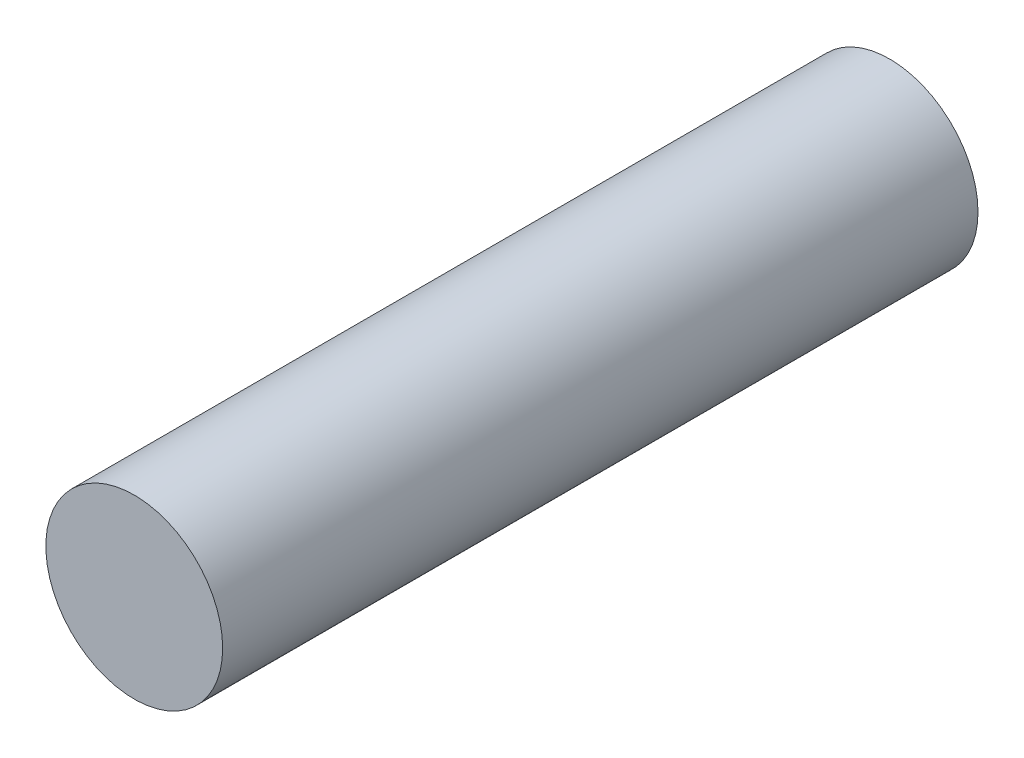
ISO-10303-21;
HEADER;
FILE_DESCRIPTION(('STEP AP214'),'2;1');
FILE_NAME('part.step','',(''),(''),'','','');
FILE_SCHEMA(('AUTOMOTIVE_DESIGN { 1 0 10303 214 1 1 1 1 }'));
ENDSEC;
DATA;
#1=APPLICATION_CONTEXT('core data for automotive mechanical design processes');
#2=APPLICATION_PROTOCOL_DEFINITION('international standard','automotive_design',2000,#1);
#3=PRODUCT_CONTEXT('',#1,'mechanical');
#4=PRODUCT('Part','Part','',(#3));
#5=PRODUCT_RELATED_PRODUCT_CATEGORY('part','',(#4));
#6=PRODUCT_DEFINITION_FORMATION('','',#4);
#7=PRODUCT_DEFINITION_CONTEXT('part definition',#1,'design');
#8=PRODUCT_DEFINITION('design','',#6,#7);
#9=PRODUCT_DEFINITION_SHAPE('','',#8);
#10=(LENGTH_UNIT() NAMED_UNIT(*) SI_UNIT(.MILLI.,.METRE.));
#11=(NAMED_UNIT(*) PLANE_ANGLE_UNIT() SI_UNIT($,.RADIAN.));
#12=(NAMED_UNIT(*) SI_UNIT($,.STERADIAN.) SOLID_ANGLE_UNIT());
#13=UNCERTAINTY_MEASURE_WITH_UNIT(LENGTH_MEASURE(1.E-05),#10,'distance_accuracy_value','');
#14=(GEOMETRIC_REPRESENTATION_CONTEXT(3) GLOBAL_UNCERTAINTY_ASSIGNED_CONTEXT((#13)) GLOBAL_UNIT_ASSIGNED_CONTEXT((#10,
#11,#12)) REPRESENTATION_CONTEXT('',''));
#15=CARTESIAN_POINT('',(0.,0.,0.));
#16=DIRECTION('',(0.,0.,1.));
#17=DIRECTION('',(1.,0.,0.));
#18=AXIS2_PLACEMENT_3D('',#15,#16,#17);
#19=CARTESIAN_POINT('',(0.,0.,44.));
#20=DIRECTION('',(0.,0.,-1.));
#21=DIRECTION('',(-1.,0.,0.));
#22=AXIS2_PLACEMENT_3D('',#19,#20,#21);
#23=CYLINDRICAL_SURFACE('',#22,5.15);
#24=CARTESIAN_POINT('',(0.,0.,44.));
#25=DIRECTION('',(0.,0.,1.));
#26=DIRECTION('',(1.,0.,0.));
#27=AXIS2_PLACEMENT_3D('',#24,#25,#26);
#28=CIRCLE('',#27,5.15);
#29=CARTESIAN_POINT('',(5.15,0.,44.));
#30=VERTEX_POINT('',#29);
#31=EDGE_CURVE('E10',#30,#30,#28,.T.);
#32=ORIENTED_EDGE('',*,*,#31,.F.);
#33=EDGE_LOOP('',(#32));
#34=FACE_BOUND('',#33,.T.);
#35=CARTESIAN_POINT('',(0.,0.,0.));
#36=DIRECTION('',(0.,0.,1.));
#37=DIRECTION('',(1.,0.,0.));
#38=AXIS2_PLACEMENT_3D('',#35,#36,#37);
#39=CIRCLE('',#38,5.15);
#40=CARTESIAN_POINT('',(5.15,0.,0.));
#41=VERTEX_POINT('',#40);
#42=EDGE_CURVE('E32',#41,#41,#39,.T.);
#43=ORIENTED_EDGE('',*,*,#42,.T.);
#44=EDGE_LOOP('',(#43));
#45=FACE_BOUND('',#44,.T.);
#46=ADVANCED_FACE('F29',(#34,#45),#23,.T.);
#47=CARTESIAN_POINT('',(0.,0.,44.));
#48=DIRECTION('',(0.,0.,1.));
#49=DIRECTION('',(1.,0.,0.));
#50=AXIS2_PLACEMENT_3D('',#47,#48,#49);
#51=PLANE('',#50);
#52=ORIENTED_EDGE('',*,*,#31,.T.);
#53=EDGE_LOOP('',(#52));
#54=FACE_BOUND('',#53,.T.);
#55=ADVANCED_FACE('F44',(#54),#51,.T.);
#56=CARTESIAN_POINT('',(0.,0.,0.));
#57=DIRECTION('',(0.,0.,1.));
#58=DIRECTION('',(1.,0.,0.));
#59=AXIS2_PLACEMENT_3D('',#56,#57,#58);
#60=PLANE('',#59);
#61=ORIENTED_EDGE('',*,*,#42,.F.);
#62=EDGE_LOOP('',(#61));
#63=FACE_BOUND('',#62,.T.);
#64=ADVANCED_FACE('F42',(#63),#60,.F.);
#65=CLOSED_SHELL('',(#46,#55,#64));
#66=MANIFOLD_SOLID_BREP('B2',#65);
#67=ADVANCED_BREP_SHAPE_REPRESENTATION('',(#18,#66),#14);
#68=SHAPE_DEFINITION_REPRESENTATION(#9,#67);
ENDSEC;
END-ISO-10303-21;
